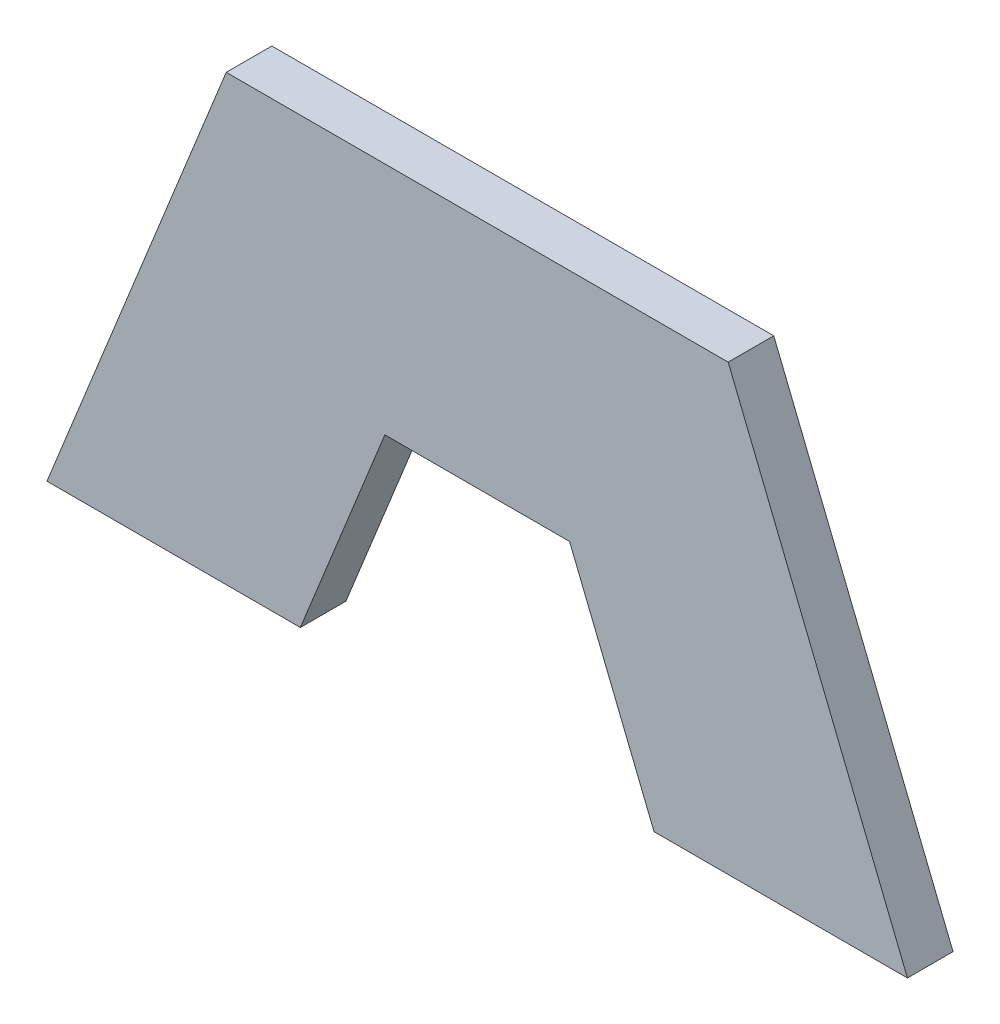
ISO-10303-21;
HEADER;
FILE_DESCRIPTION(('STEP AP214'),'2;1');
FILE_NAME('part.step','',(''),(''),'','','');
FILE_SCHEMA(('AUTOMOTIVE_DESIGN { 1 0 10303 214 1 1 1 1 }'));
ENDSEC;
DATA;
#1=APPLICATION_CONTEXT('core data for automotive mechanical design processes');
#2=APPLICATION_PROTOCOL_DEFINITION('international standard','automotive_design',2000,#1);
#3=PRODUCT_CONTEXT('',#1,'mechanical');
#4=PRODUCT('Part','Part','',(#3));
#5=PRODUCT_RELATED_PRODUCT_CATEGORY('part','',(#4));
#6=PRODUCT_DEFINITION_FORMATION('','',#4);
#7=PRODUCT_DEFINITION_CONTEXT('part definition',#1,'design');
#8=PRODUCT_DEFINITION('design','',#6,#7);
#9=PRODUCT_DEFINITION_SHAPE('','',#8);
#10=(LENGTH_UNIT() NAMED_UNIT(*) SI_UNIT(.MILLI.,.METRE.));
#11=(NAMED_UNIT(*) PLANE_ANGLE_UNIT() SI_UNIT($,.RADIAN.));
#12=(NAMED_UNIT(*) SI_UNIT($,.STERADIAN.) SOLID_ANGLE_UNIT());
#13=UNCERTAINTY_MEASURE_WITH_UNIT(LENGTH_MEASURE(1.E-05),#10,'distance_accuracy_value','');
#14=(GEOMETRIC_REPRESENTATION_CONTEXT(3) GLOBAL_UNCERTAINTY_ASSIGNED_CONTEXT((#13)) GLOBAL_UNIT_ASSIGNED_CONTEXT((#10,
#11,#12)) REPRESENTATION_CONTEXT('',''));
#15=CARTESIAN_POINT('',(0.,0.,0.));
#16=DIRECTION('',(0.,0.,1.));
#17=DIRECTION('',(1.,0.,0.));
#18=AXIS2_PLACEMENT_3D('',#15,#16,#17);
#19=CARTESIAN_POINT('',(0.0501234870327461,-0.56437912510646,0.));
#20=DIRECTION('',(0.927183854567465,0.374606593414235,0.));
#21=DIRECTION('',(-0.374606593414235,0.927183854567465,0.));
#22=AXIS2_PLACEMENT_3D('',#19,#20,#21);
#23=PLANE('',#22);
#24=DIRECTION('',(-0.374606593414235,0.927183854567465,0.));
#25=VECTOR('',#24,1.);
#26=CARTESIAN_POINT('',(0.0501234870327461,-0.56437912510646,0.));
#27=LINE('',#26,#25);
#28=CARTESIAN_POINT('',(0.0501234870327461,-0.56437912510646,0.));
#29=VERTEX_POINT('',#28);
#30=CARTESIAN_POINT('',(0.0383251136430461,-0.535177126237764,0.));
#31=VERTEX_POINT('',#30);
#32=EDGE_CURVE('E11',#29,#31,#27,.T.);
#33=ORIENTED_EDGE('',*,*,#32,.T.);
#34=DIRECTION('',(0.,0.,1.));
#35=VECTOR('',#34,1.);
#36=CARTESIAN_POINT('',(0.0383251136430461,-0.535177126237764,0.));
#37=LINE('',#36,#35);
#38=CARTESIAN_POINT('',(0.0383251136430461,-0.535177126237764,0.003));
#39=VERTEX_POINT('',#38);
#40=EDGE_CURVE('E24',#31,#39,#37,.T.);
#41=ORIENTED_EDGE('',*,*,#40,.T.);
#42=DIRECTION('',(-0.374606593414235,0.927183854567465,0.));
#43=VECTOR('',#42,1.);
#44=CARTESIAN_POINT('',(0.0501234870327461,-0.56437912510646,0.003));
#45=LINE('',#44,#43);
#46=CARTESIAN_POINT('',(0.0501234870327461,-0.56437912510646,0.003));
#47=VERTEX_POINT('',#46);
#48=EDGE_CURVE('E100',#47,#39,#45,.T.);
#49=ORIENTED_EDGE('',*,*,#48,.F.);
#50=DIRECTION('',(0.,0.,1.));
#51=VECTOR('',#50,1.);
#52=CARTESIAN_POINT('',(0.0501234870327461,-0.56437912510646,0.));
#53=LINE('',#52,#51);
#54=EDGE_CURVE('E146',#29,#47,#53,.T.);
#55=ORIENTED_EDGE('',*,*,#54,.F.);
#56=EDGE_LOOP('',(#33,#41,#49,#55));
#57=FACE_BOUND('',#56,.T.);
#58=ADVANCED_FACE('F17',(#57),#23,.T.);
#59=CARTESIAN_POINT('',(0.033446487032746,-0.56437912510646,0.));
#60=DIRECTION('',(0.,-1.,0.));
#61=DIRECTION('',(1.,0.,0.));
#62=AXIS2_PLACEMENT_3D('',#59,#60,#61);
#63=PLANE('',#62);
#64=DIRECTION('',(1.,0.,0.));
#65=VECTOR('',#64,1.);
#66=CARTESIAN_POINT('',(0.033446487032746,-0.56437912510646,0.));
#67=LINE('',#66,#65);
#68=CARTESIAN_POINT('',(0.033446487032746,-0.56437912510646,0.));
#69=VERTEX_POINT('',#68);
#70=EDGE_CURVE('E143',#69,#29,#67,.T.);
#71=ORIENTED_EDGE('',*,*,#70,.T.);
#72=ORIENTED_EDGE('',*,*,#54,.T.);
#73=DIRECTION('',(1.,0.,0.));
#74=VECTOR('',#73,1.);
#75=CARTESIAN_POINT('',(0.033446487032746,-0.56437912510646,0.003));
#76=LINE('',#75,#74);
#77=CARTESIAN_POINT('',(0.033446487032746,-0.56437912510646,0.003));
#78=VERTEX_POINT('',#77);
#79=EDGE_CURVE('E141',#78,#47,#76,.T.);
#80=ORIENTED_EDGE('',*,*,#79,.F.);
#81=DIRECTION('',(0.,0.,1.));
#82=VECTOR('',#81,1.);
#83=CARTESIAN_POINT('',(0.033446487032746,-0.56437912510646,0.));
#84=LINE('',#83,#82);
#85=EDGE_CURVE('E138',#69,#78,#84,.T.);
#86=ORIENTED_EDGE('',*,*,#85,.F.);
#87=EDGE_LOOP('',(#71,#72,#80,#86));
#88=FACE_BOUND('',#87,.T.);
#89=ADVANCED_FACE('F163',(#88),#63,.T.);
#90=CARTESIAN_POINT('',(0.027886545492761,-0.550617786895035,0.));
#91=DIRECTION('',(-0.927183854567213,-0.374606593414858,0.));
#92=DIRECTION('',(0.374606593414858,-0.927183854567213,0.));
#93=AXIS2_PLACEMENT_3D('',#90,#91,#92);
#94=PLANE('',#93);
#95=DIRECTION('',(0.374606593414858,-0.927183854567213,0.));
#96=VECTOR('',#95,1.);
#97=CARTESIAN_POINT('',(0.027886545492761,-0.550617786895035,0.));
#98=LINE('',#97,#96);
#99=CARTESIAN_POINT('',(0.027886545492761,-0.550617786895035,0.));
#100=VERTEX_POINT('',#99);
#101=EDGE_CURVE('E135',#100,#69,#98,.T.);
#102=ORIENTED_EDGE('',*,*,#101,.T.);
#103=ORIENTED_EDGE('',*,*,#85,.T.);
#104=DIRECTION('',(0.374606593414858,-0.927183854567213,0.));
#105=VECTOR('',#104,1.);
#106=CARTESIAN_POINT('',(0.027886545492761,-0.550617786895035,0.003));
#107=LINE('',#106,#105);
#108=CARTESIAN_POINT('',(0.027886545492761,-0.550617786895035,0.003));
#109=VERTEX_POINT('',#108);
#110=EDGE_CURVE('E132',#109,#78,#107,.T.);
#111=ORIENTED_EDGE('',*,*,#110,.F.);
#112=DIRECTION('',(0.,0.,1.));
#113=VECTOR('',#112,1.);
#114=CARTESIAN_POINT('',(0.027886545492761,-0.550617786895035,0.));
#115=LINE('',#114,#113);
#116=EDGE_CURVE('E129',#100,#109,#115,.T.);
#117=ORIENTED_EDGE('',*,*,#116,.F.);
#118=EDGE_LOOP('',(#102,#103,#111,#117));
#119=FACE_BOUND('',#118,.T.);
#120=ADVANCED_FACE('F160',(#119),#94,.T.);
#121=CARTESIAN_POINT('',(0.015730260538666,-0.550617786895035,0.));
#122=DIRECTION('',(0.,-1.,0.));
#123=DIRECTION('',(1.,0.,0.));
#124=AXIS2_PLACEMENT_3D('',#121,#122,#123);
#125=PLANE('',#124);
#126=DIRECTION('',(1.,0.,0.));
#127=VECTOR('',#126,1.);
#128=CARTESIAN_POINT('',(0.015730260538666,-0.550617786895035,0.));
#129=LINE('',#128,#127);
#130=CARTESIAN_POINT('',(0.015730260538666,-0.550617786895035,0.));
#131=VERTEX_POINT('',#130);
#132=EDGE_CURVE('E126',#131,#100,#129,.T.);
#133=ORIENTED_EDGE('',*,*,#132,.T.);
#134=ORIENTED_EDGE('',*,*,#116,.T.);
#135=DIRECTION('',(1.,0.,0.));
#136=VECTOR('',#135,1.);
#137=CARTESIAN_POINT('',(0.015730260538666,-0.550617786895035,0.003));
#138=LINE('',#137,#136);
#139=CARTESIAN_POINT('',(0.015730260538666,-0.550617786895035,0.003));
#140=VERTEX_POINT('',#139);
#141=EDGE_CURVE('E123',#140,#109,#138,.T.);
#142=ORIENTED_EDGE('',*,*,#141,.F.);
#143=DIRECTION('',(0.,0.,1.));
#144=VECTOR('',#143,1.);
#145=CARTESIAN_POINT('',(0.015730260538666,-0.550617786895035,0.));
#146=LINE('',#145,#144);
#147=EDGE_CURVE('E120',#131,#140,#146,.T.);
#148=ORIENTED_EDGE('',*,*,#147,.F.);
#149=EDGE_LOOP('',(#133,#134,#142,#148));
#150=FACE_BOUND('',#149,.T.);
#151=ADVANCED_FACE('F157',(#150),#125,.T.);
#152=CARTESIAN_POINT('',(0.010170318998681,-0.56437912510646,0.));
#153=DIRECTION('',(0.927183854567213,-0.374606593414858,0.));
#154=DIRECTION('',(0.374606593414858,0.927183854567213,0.));
#155=AXIS2_PLACEMENT_3D('',#152,#153,#154);
#156=PLANE('',#155);
#157=DIRECTION('',(0.374606593414858,0.927183854567213,0.));
#158=VECTOR('',#157,1.);
#159=CARTESIAN_POINT('',(0.010170318998681,-0.56437912510646,0.));
#160=LINE('',#159,#158);
#161=CARTESIAN_POINT('',(0.010170318998681,-0.56437912510646,0.));
#162=VERTEX_POINT('',#161);
#163=EDGE_CURVE('E117',#162,#131,#160,.T.);
#164=ORIENTED_EDGE('',*,*,#163,.T.);
#165=ORIENTED_EDGE('',*,*,#147,.T.);
#166=DIRECTION('',(0.374606593414858,0.927183854567213,0.));
#167=VECTOR('',#166,1.);
#168=CARTESIAN_POINT('',(0.010170318998681,-0.56437912510646,0.003));
#169=LINE('',#168,#167);
#170=CARTESIAN_POINT('',(0.010170318998681,-0.56437912510646,0.003));
#171=VERTEX_POINT('',#170);
#172=EDGE_CURVE('E114',#171,#140,#169,.T.);
#173=ORIENTED_EDGE('',*,*,#172,.F.);
#174=DIRECTION('',(0.,0.,1.));
#175=VECTOR('',#174,1.);
#176=CARTESIAN_POINT('',(0.010170318998681,-0.56437912510646,0.));
#177=LINE('',#176,#175);
#178=EDGE_CURVE('E111',#162,#171,#177,.T.);
#179=ORIENTED_EDGE('',*,*,#178,.F.);
#180=EDGE_LOOP('',(#164,#165,#173,#179));
#181=FACE_BOUND('',#180,.T.);
#182=ADVANCED_FACE('F154',(#181),#156,.T.);
#183=CARTESIAN_POINT('',(-0.00650668100131891,-0.56437912510646,0.));
#184=DIRECTION('',(0.,-1.,0.));
#185=DIRECTION('',(1.,0.,0.));
#186=AXIS2_PLACEMENT_3D('',#183,#184,#185);
#187=PLANE('',#186);
#188=DIRECTION('',(1.,0.,0.));
#189=VECTOR('',#188,1.);
#190=CARTESIAN_POINT('',(-0.00650668100131891,-0.56437912510646,0.));
#191=LINE('',#190,#189);
#192=CARTESIAN_POINT('',(-0.00650668100131891,-0.56437912510646,0.));
#193=VERTEX_POINT('',#192);
#194=EDGE_CURVE('E108',#193,#162,#191,.T.);
#195=ORIENTED_EDGE('',*,*,#194,.T.);
#196=ORIENTED_EDGE('',*,*,#178,.T.);
#197=DIRECTION('',(1.,0.,0.));
#198=VECTOR('',#197,1.);
#199=CARTESIAN_POINT('',(-0.00650668100131891,-0.56437912510646,0.003));
#200=LINE('',#199,#198);
#201=CARTESIAN_POINT('',(-0.00650668100131891,-0.56437912510646,0.003));
#202=VERTEX_POINT('',#201);
#203=EDGE_CURVE('E106',#202,#171,#200,.T.);
#204=ORIENTED_EDGE('',*,*,#203,.F.);
#205=DIRECTION('',(0.,0.,1.));
#206=VECTOR('',#205,1.);
#207=CARTESIAN_POINT('',(-0.00650668100131891,-0.56437912510646,0.));
#208=LINE('',#207,#206);
#209=EDGE_CURVE('E85',#193,#202,#208,.T.);
#210=ORIENTED_EDGE('',*,*,#209,.F.);
#211=EDGE_LOOP('',(#195,#196,#204,#210));
#212=FACE_BOUND('',#211,.T.);
#213=ADVANCED_FACE('F152',(#212),#187,.T.);
#214=CARTESIAN_POINT('',(0.00529169238838103,-0.535177126237764,0.));
#215=DIRECTION('',(-0.927183854567466,0.374606593414233,0.));
#216=DIRECTION('',(-0.374606593414233,-0.927183854567466,0.));
#217=AXIS2_PLACEMENT_3D('',#214,#215,#216);
#218=PLANE('',#217);
#219=DIRECTION('',(-0.374606593414233,-0.927183854567466,0.));
#220=VECTOR('',#219,1.);
#221=CARTESIAN_POINT('',(0.00529169238838103,-0.535177126237764,0.));
#222=LINE('',#221,#220);
#223=CARTESIAN_POINT('',(0.00529169238838103,-0.535177126237764,0.));
#224=VERTEX_POINT('',#223);
#225=EDGE_CURVE('E89',#224,#193,#222,.T.);
#226=ORIENTED_EDGE('',*,*,#225,.T.);
#227=ORIENTED_EDGE('',*,*,#209,.T.);
#228=DIRECTION('',(-0.374606593414233,-0.927183854567466,0.));
#229=VECTOR('',#228,1.);
#230=CARTESIAN_POINT('',(0.00529169238838103,-0.535177126237764,0.003));
#231=LINE('',#230,#229);
#232=CARTESIAN_POINT('',(0.00529169238838103,-0.535177126237764,0.003));
#233=VERTEX_POINT('',#232);
#234=EDGE_CURVE('E78',#233,#202,#231,.T.);
#235=ORIENTED_EDGE('',*,*,#234,.F.);
#236=DIRECTION('',(0.,0.,1.));
#237=VECTOR('',#236,1.);
#238=CARTESIAN_POINT('',(0.00529169238838103,-0.535177126237764,0.));
#239=LINE('',#238,#237);
#240=EDGE_CURVE('E82',#224,#233,#239,.T.);
#241=ORIENTED_EDGE('',*,*,#240,.F.);
#242=EDGE_LOOP('',(#226,#227,#235,#241));
#243=FACE_BOUND('',#242,.T.);
#244=ADVANCED_FACE('F81',(#243),#218,.T.);
#245=CARTESIAN_POINT('',(0.0383251136430461,-0.535177126237764,0.));
#246=DIRECTION('',(0.,1.,0.));
#247=DIRECTION('',(-1.,0.,0.));
#248=AXIS2_PLACEMENT_3D('',#245,#246,#247);
#249=PLANE('',#248);
#250=DIRECTION('',(-1.,0.,0.));
#251=VECTOR('',#250,1.);
#252=CARTESIAN_POINT('',(0.0383251136430461,-0.535177126237764,0.));
#253=LINE('',#252,#251);
#254=EDGE_CURVE('E95',#31,#224,#253,.T.);
#255=ORIENTED_EDGE('',*,*,#254,.T.);
#256=ORIENTED_EDGE('',*,*,#240,.T.);
#257=DIRECTION('',(-1.,0.,0.));
#258=VECTOR('',#257,1.);
#259=CARTESIAN_POINT('',(0.0383251136430461,-0.535177126237764,0.003));
#260=LINE('',#259,#258);
#261=EDGE_CURVE('E94',#39,#233,#260,.T.);
#262=ORIENTED_EDGE('',*,*,#261,.F.);
#263=ORIENTED_EDGE('',*,*,#40,.F.);
#264=EDGE_LOOP('',(#255,#256,#262,#263));
#265=FACE_BOUND('',#264,.T.);
#266=ADVANCED_FACE('F93',(#265),#249,.T.);
#267=CARTESIAN_POINT('',(0.0218084030157136,-0.549778125672112,0.003));
#268=DIRECTION('',(0.,0.,1.));
#269=DIRECTION('',(1.,0.,0.));
#270=AXIS2_PLACEMENT_3D('',#267,#268,#269);
#271=PLANE('',#270);
#272=ORIENTED_EDGE('',*,*,#261,.T.);
#273=ORIENTED_EDGE('',*,*,#234,.T.);
#274=ORIENTED_EDGE('',*,*,#203,.T.);
#275=ORIENTED_EDGE('',*,*,#172,.T.);
#276=ORIENTED_EDGE('',*,*,#141,.T.);
#277=ORIENTED_EDGE('',*,*,#110,.T.);
#278=ORIENTED_EDGE('',*,*,#79,.T.);
#279=ORIENTED_EDGE('',*,*,#48,.T.);
#280=EDGE_LOOP('',(#272,#273,#274,#275,#276,#277,#278,#279));
#281=FACE_BOUND('',#280,.T.);
#282=ADVANCED_FACE('F98',(#281),#271,.T.);
#283=CARTESIAN_POINT('',(0.0218084030157136,-0.549778125672112,0.));
#284=DIRECTION('',(0.,0.,1.));
#285=DIRECTION('',(1.,0.,0.));
#286=AXIS2_PLACEMENT_3D('',#283,#284,#285);
#287=PLANE('',#286);
#288=ORIENTED_EDGE('',*,*,#254,.F.);
#289=ORIENTED_EDGE('',*,*,#32,.F.);
#290=ORIENTED_EDGE('',*,*,#70,.F.);
#291=ORIENTED_EDGE('',*,*,#101,.F.);
#292=ORIENTED_EDGE('',*,*,#132,.F.);
#293=ORIENTED_EDGE('',*,*,#163,.F.);
#294=ORIENTED_EDGE('',*,*,#194,.F.);
#295=ORIENTED_EDGE('',*,*,#225,.F.);
#296=EDGE_LOOP('',(#288,#289,#290,#291,#292,#293,#294,#295));
#297=FACE_BOUND('',#296,.T.);
#298=ADVANCED_FACE('F149',(#297),#287,.F.);
#299=CLOSED_SHELL('',(#58,#89,#120,#151,#182,#213,#244,#266,#282,#298));
#300=MANIFOLD_SOLID_BREP('B1',#299);
#301=ADVANCED_BREP_SHAPE_REPRESENTATION('',(#18,#300),#14);
#302=SHAPE_DEFINITION_REPRESENTATION(#9,#301);
ENDSEC;
END-ISO-10303-21;
